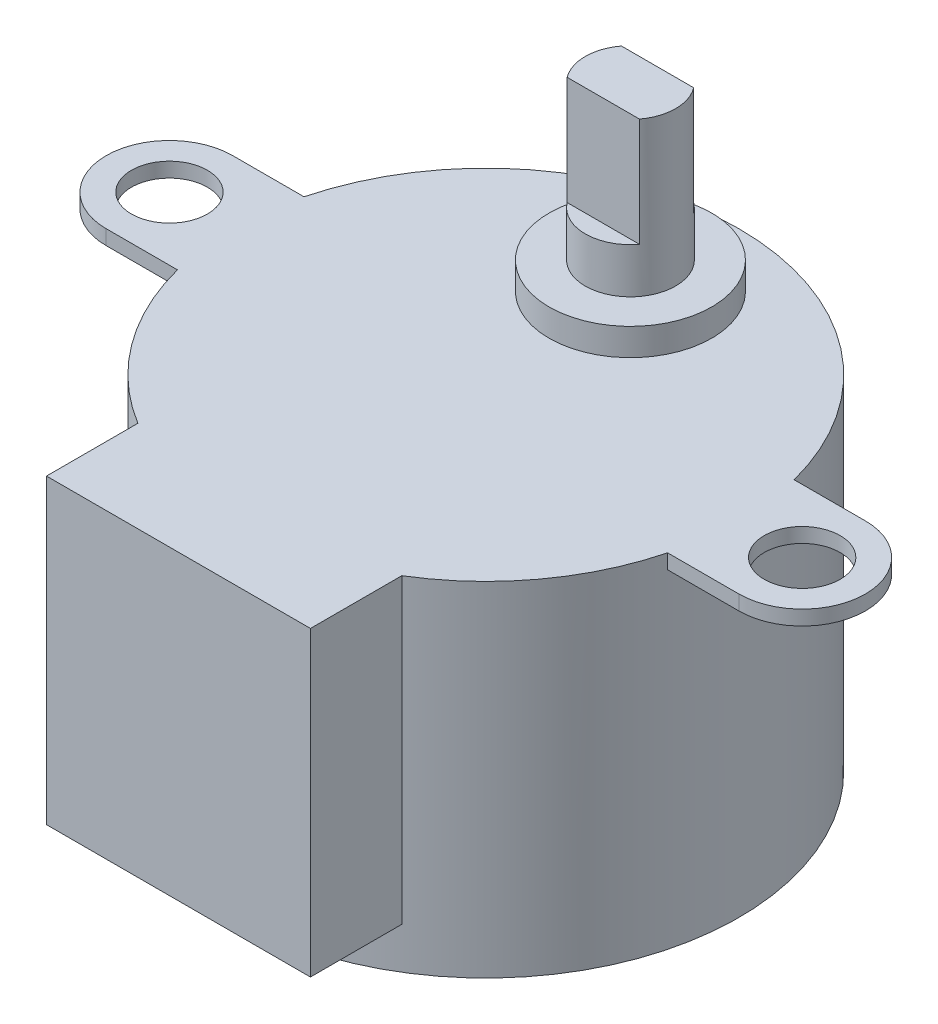
ISO-10303-21;
HEADER;
FILE_DESCRIPTION(('STEP AP214'),'2;1');
FILE_NAME('part.step','',(''),(''),'','','');
FILE_SCHEMA(('AUTOMOTIVE_DESIGN { 1 0 10303 214 1 1 1 1 }'));
ENDSEC;
DATA;
#1=APPLICATION_CONTEXT('core data for automotive mechanical design processes');
#2=APPLICATION_PROTOCOL_DEFINITION('international standard','automotive_design',2000,#1);
#3=PRODUCT_CONTEXT('',#1,'mechanical');
#4=PRODUCT('Part','Part','',(#3));
#5=PRODUCT_RELATED_PRODUCT_CATEGORY('part','',(#4));
#6=PRODUCT_DEFINITION_FORMATION('','',#4);
#7=PRODUCT_DEFINITION_CONTEXT('part definition',#1,'design');
#8=PRODUCT_DEFINITION('design','',#6,#7);
#9=PRODUCT_DEFINITION_SHAPE('','',#8);
#10=(LENGTH_UNIT() NAMED_UNIT(*) SI_UNIT(.MILLI.,.METRE.));
#11=(NAMED_UNIT(*) PLANE_ANGLE_UNIT() SI_UNIT($,.RADIAN.));
#12=(NAMED_UNIT(*) SI_UNIT($,.STERADIAN.) SOLID_ANGLE_UNIT());
#13=UNCERTAINTY_MEASURE_WITH_UNIT(LENGTH_MEASURE(1.E-05),#10,'distance_accuracy_value','');
#14=(GEOMETRIC_REPRESENTATION_CONTEXT(3) GLOBAL_UNCERTAINTY_ASSIGNED_CONTEXT((#13)) GLOBAL_UNIT_ASSIGNED_CONTEXT((#10,
#11,#12)) REPRESENTATION_CONTEXT('',''));
#15=CARTESIAN_POINT('',(0.,0.,0.));
#16=DIRECTION('',(0.,0.,1.));
#17=DIRECTION('',(1.,0.,0.));
#18=AXIS2_PLACEMENT_3D('',#15,#16,#17);
#19=CARTESIAN_POINT('',(0.,10.,-8.));
#20=DIRECTION('',(0.,-1.,0.));
#21=DIRECTION('',(0.,0.,-1.));
#22=AXIS2_PLACEMENT_3D('',#19,#20,#21);
#23=CYLINDRICAL_SURFACE('',#22,2.5);
#24=CARTESIAN_POINT('',(0.,1.5,-8.));
#25=DIRECTION('',(0.,1.,0.));
#26=DIRECTION('',(0.,0.,1.));
#27=AXIS2_PLACEMENT_3D('',#24,#25,#26);
#28=CIRCLE('',#27,2.5);
#29=CARTESIAN_POINT('',(0.,1.5,-5.5));
#30=VERTEX_POINT('',#29);
#31=EDGE_CURVE('E207',#30,#30,#28,.F.);
#32=ORIENTED_EDGE('',*,*,#31,.F.);
#33=EDGE_LOOP('',(#32));
#34=FACE_BOUND('',#33,.T.);
#35=DIRECTION('',(0.,1.,0.));
#36=VECTOR('',#35,1.);
#37=CARTESIAN_POINT('',(-2.,4.,-6.5));
#38=LINE('',#37,#36);
#39=CARTESIAN_POINT('',(-2.,4.,-6.5));
#40=VERTEX_POINT('',#39);
#41=CARTESIAN_POINT('',(-2.,10.,-6.5));
#42=VERTEX_POINT('',#41);
#43=EDGE_CURVE('E185',#40,#42,#38,.T.);
#44=ORIENTED_EDGE('',*,*,#43,.T.);
#45=CARTESIAN_POINT('',(0.,10.,-8.));
#46=DIRECTION('',(0.,1.,0.));
#47=DIRECTION('',(0.,0.,1.));
#48=AXIS2_PLACEMENT_3D('',#45,#46,#47);
#49=CIRCLE('',#48,2.5);
#50=CARTESIAN_POINT('',(-2.,10.,-9.5));
#51=VERTEX_POINT('',#50);
#52=EDGE_CURVE('E204',#51,#42,#49,.T.);
#53=ORIENTED_EDGE('',*,*,#52,.F.);
#54=DIRECTION('',(0.,1.,0.));
#55=VECTOR('',#54,1.);
#56=CARTESIAN_POINT('',(-2.,4.,-9.5));
#57=LINE('',#56,#55);
#58=CARTESIAN_POINT('',(-2.,4.,-9.5));
#59=VERTEX_POINT('',#58);
#60=EDGE_CURVE('E196',#59,#51,#57,.T.);
#61=ORIENTED_EDGE('',*,*,#60,.F.);
#62=CARTESIAN_POINT('',(0.,4.,-8.));
#63=DIRECTION('',(0.,1.,0.));
#64=DIRECTION('',(0.,0.,1.));
#65=AXIS2_PLACEMENT_3D('',#62,#63,#64);
#66=CIRCLE('',#65,2.5);
#67=CARTESIAN_POINT('',(2.,4.,-9.5));
#68=VERTEX_POINT('',#67);
#69=EDGE_CURVE('E191',#68,#59,#66,.T.);
#70=ORIENTED_EDGE('',*,*,#69,.F.);
#71=DIRECTION('',(0.,1.,0.));
#72=VECTOR('',#71,1.);
#73=CARTESIAN_POINT('',(2.,4.,-9.5));
#74=LINE('',#73,#72);
#75=CARTESIAN_POINT('',(2.,10.,-9.5));
#76=VERTEX_POINT('',#75);
#77=EDGE_CURVE('E199',#68,#76,#74,.T.);
#78=ORIENTED_EDGE('',*,*,#77,.T.);
#79=CARTESIAN_POINT('',(2.,10.,-6.5));
#80=VERTEX_POINT('',#79);
#81=EDGE_CURVE('E202',#80,#76,#49,.T.);
#82=ORIENTED_EDGE('',*,*,#81,.F.);
#83=DIRECTION('',(0.,1.,0.));
#84=VECTOR('',#83,1.);
#85=CARTESIAN_POINT('',(2.,4.,-6.5));
#86=LINE('',#85,#84);
#87=CARTESIAN_POINT('',(2.,4.,-6.5));
#88=VERTEX_POINT('',#87);
#89=EDGE_CURVE('E56',#88,#80,#86,.T.);
#90=ORIENTED_EDGE('',*,*,#89,.F.);
#91=CARTESIAN_POINT('',(0.,4.,-8.));
#92=DIRECTION('',(0.,1.,0.));
#93=DIRECTION('',(0.,0.,1.));
#94=AXIS2_PLACEMENT_3D('',#91,#92,#93);
#95=CIRCLE('',#94,2.5);
#96=EDGE_CURVE('E182',#40,#88,#95,.T.);
#97=ORIENTED_EDGE('',*,*,#96,.F.);
#98=EDGE_LOOP('',(#44,#53,#61,#70,#78,#82,#90,#97));
#99=FACE_BOUND('',#98,.T.);
#100=ADVANCED_FACE('F33',(#34,#99),#23,.T.);
#101=CARTESIAN_POINT('',(0.,10.,-8.));
#102=DIRECTION('',(0.,1.,0.));
#103=DIRECTION('',(0.,0.,1.));
#104=AXIS2_PLACEMENT_3D('',#101,#102,#103);
#105=PLANE('',#104);
#106=ORIENTED_EDGE('',*,*,#52,.T.);
#107=DIRECTION('',(1.,0.,0.));
#108=VECTOR('',#107,1.);
#109=CARTESIAN_POINT('',(0.,10.,-6.5));
#110=LINE('',#109,#108);
#111=EDGE_CURVE('E176',#42,#80,#110,.T.);
#112=ORIENTED_EDGE('',*,*,#111,.T.);
#113=ORIENTED_EDGE('',*,*,#81,.T.);
#114=DIRECTION('',(1.,0.,0.));
#115=VECTOR('',#114,1.);
#116=CARTESIAN_POINT('',(0.,10.,-9.5));
#117=LINE('',#116,#115);
#118=EDGE_CURVE('E188',#51,#76,#117,.T.);
#119=ORIENTED_EDGE('',*,*,#118,.F.);
#120=EDGE_LOOP('',(#106,#112,#113,#119));
#121=FACE_BOUND('',#120,.T.);
#122=ADVANCED_FACE('F290',(#121),#105,.T.);
#123=CARTESIAN_POINT('',(0.,-19.,0.));
#124=DIRECTION('',(0.,1.,0.));
#125=DIRECTION('',(0.,0.,1.));
#126=AXIS2_PLACEMENT_3D('',#123,#124,#125);
#127=CYLINDRICAL_SURFACE('',#126,14.);
#128=DIRECTION('',(0.,1.,0.));
#129=VECTOR('',#128,1.);
#130=CARTESIAN_POINT('',(-7.3,-16.7,11.9461290801665));
#131=LINE('',#130,#129);
#132=CARTESIAN_POINT('',(-7.3,-16.7,11.9461290801665));
#133=VERTEX_POINT('',#132);
#134=CARTESIAN_POINT('',(-7.3,0.,11.9461290801665));
#135=VERTEX_POINT('',#134);
#136=EDGE_CURVE('E167',#133,#135,#131,.T.);
#137=ORIENTED_EDGE('',*,*,#136,.T.);
#138=CARTESIAN_POINT('',(0.,0.,0.));
#139=DIRECTION('',(0.,1.,0.));
#140=DIRECTION('',(0.,0.,1.));
#141=AXIS2_PLACEMENT_3D('',#138,#139,#140);
#142=CIRCLE('',#141,14.);
#143=CARTESIAN_POINT('',(-13.555441711726,0.,3.5));
#144=VERTEX_POINT('',#143);
#145=EDGE_CURVE('E278',#144,#135,#142,.T.);
#146=ORIENTED_EDGE('',*,*,#145,.F.);
#147=DIRECTION('',(0.,1.,0.));
#148=VECTOR('',#147,1.);
#149=CARTESIAN_POINT('',(-13.555441711726,-19.,3.5));
#150=LINE('',#149,#148);
#151=CARTESIAN_POINT('',(-13.555441711726,-0.812799999999999,3.5));
#152=VERTEX_POINT('',#151);
#153=EDGE_CURVE('E256',#152,#144,#150,.T.);
#154=ORIENTED_EDGE('',*,*,#153,.F.);
#155=CARTESIAN_POINT('',(0.,-0.812799999999999,0.));
#156=DIRECTION('',(0.,1.,0.));
#157=DIRECTION('',(0.,0.,1.));
#158=AXIS2_PLACEMENT_3D('',#155,#156,#157);
#159=CIRCLE('',#158,14.);
#160=CARTESIAN_POINT('',(-13.555441711726,-0.812799999999999,-3.5));
#161=VERTEX_POINT('',#160);
#162=EDGE_CURVE('E41',#152,#161,#159,.F.);
#163=ORIENTED_EDGE('',*,*,#162,.T.);
#164=DIRECTION('',(0.,1.,0.));
#165=VECTOR('',#164,1.);
#166=CARTESIAN_POINT('',(-13.555441711726,-19.,-3.5));
#167=LINE('',#166,#165);
#168=CARTESIAN_POINT('',(-13.555441711726,0.,-3.5));
#169=VERTEX_POINT('',#168);
#170=EDGE_CURVE('E270',#169,#161,#167,.F.);
#171=ORIENTED_EDGE('',*,*,#170,.F.);
#172=CARTESIAN_POINT('',(13.555441711726,0.,-3.50000000000001));
#173=VERTEX_POINT('',#172);
#174=EDGE_CURVE('E277',#173,#169,#142,.T.);
#175=ORIENTED_EDGE('',*,*,#174,.F.);
#176=DIRECTION('',(0.,1.,0.));
#177=VECTOR('',#176,1.);
#178=CARTESIAN_POINT('',(13.555441711726,-19.,-3.50000000000001));
#179=LINE('',#178,#177);
#180=CARTESIAN_POINT('',(13.555441711726,-0.812799999999999,-3.50000000000001));
#181=VERTEX_POINT('',#180);
#182=EDGE_CURVE('E267',#181,#173,#179,.T.);
#183=ORIENTED_EDGE('',*,*,#182,.F.);
#184=CARTESIAN_POINT('',(13.555441711726,-0.812799999999999,3.49999999999999));
#185=VERTEX_POINT('',#184);
#186=EDGE_CURVE('E276',#181,#185,#159,.F.);
#187=ORIENTED_EDGE('',*,*,#186,.T.);
#188=DIRECTION('',(0.,1.,0.));
#189=VECTOR('',#188,1.);
#190=CARTESIAN_POINT('',(13.555441711726,-19.,3.49999999999999));
#191=LINE('',#190,#189);
#192=CARTESIAN_POINT('',(13.555441711726,0.,3.49999999999999));
#193=VERTEX_POINT('',#192);
#194=EDGE_CURVE('E265',#193,#185,#191,.F.);
#195=ORIENTED_EDGE('',*,*,#194,.F.);
#196=CARTESIAN_POINT('',(7.3,0.,11.9461290801665));
#197=VERTEX_POINT('',#196);
#198=EDGE_CURVE('E272',#197,#193,#142,.T.);
#199=ORIENTED_EDGE('',*,*,#198,.F.);
#200=DIRECTION('',(0.,1.,0.));
#201=VECTOR('',#200,1.);
#202=CARTESIAN_POINT('',(7.3,-16.7,11.9461290801665));
#203=LINE('',#202,#201);
#204=CARTESIAN_POINT('',(7.3,-16.7,11.9461290801665));
#205=VERTEX_POINT('',#204);
#206=EDGE_CURVE('E177',#205,#197,#203,.T.);
#207=ORIENTED_EDGE('',*,*,#206,.F.);
#208=CARTESIAN_POINT('',(0.,-16.7,0.));
#209=DIRECTION('',(0.,1.,0.));
#210=DIRECTION('',(0.,0.,1.));
#211=AXIS2_PLACEMENT_3D('',#208,#209,#210);
#212=CIRCLE('',#211,14.);
#213=EDGE_CURVE('E11',#205,#133,#212,.F.);
#214=ORIENTED_EDGE('',*,*,#213,.T.);
#215=EDGE_LOOP('',(#137,#146,#154,#163,#171,#175,#183,#187,#195,#199,#207,#214));
#216=FACE_BOUND('',#215,.T.);
#217=CARTESIAN_POINT('',(0.,-19.,0.));
#218=DIRECTION('',(0.,1.,0.));
#219=DIRECTION('',(0.,0.,1.));
#220=AXIS2_PLACEMENT_3D('',#217,#218,#219);
#221=CIRCLE('',#220,14.);
#222=CARTESIAN_POINT('',(0.,-19.,14.));
#223=VERTEX_POINT('',#222);
#224=EDGE_CURVE('E273',#223,#223,#221,.T.);
#225=ORIENTED_EDGE('',*,*,#224,.T.);
#226=EDGE_LOOP('',(#225));
#227=FACE_BOUND('',#226,.T.);
#228=ADVANCED_FACE('F35',(#216,#227),#127,.T.);
#229=CARTESIAN_POINT('',(0.,-19.,0.));
#230=DIRECTION('',(0.,1.,0.));
#231=DIRECTION('',(0.,0.,1.));
#232=AXIS2_PLACEMENT_3D('',#229,#230,#231);
#233=PLANE('',#232);
#234=ORIENTED_EDGE('',*,*,#224,.F.);
#235=EDGE_LOOP('',(#234));
#236=FACE_BOUND('',#235,.T.);
#237=ADVANCED_FACE('F357',(#236),#233,.F.);
#238=CARTESIAN_POINT('',(0.,0.,0.));
#239=DIRECTION('',(0.,1.,0.));
#240=DIRECTION('',(0.,0.,1.));
#241=AXIS2_PLACEMENT_3D('',#238,#239,#240);
#242=PLANE('',#241);
#243=ORIENTED_EDGE('',*,*,#145,.T.);
#244=DIRECTION('',(0.,0.,1.));
#245=VECTOR('',#244,1.);
#246=CARTESIAN_POINT('',(-7.3,0.,11.9461290801665));
#247=LINE('',#246,#245);
#248=CARTESIAN_POINT('',(-7.3,0.,17.));
#249=VERTEX_POINT('',#248);
#250=EDGE_CURVE('E172',#135,#249,#247,.T.);
#251=ORIENTED_EDGE('',*,*,#250,.T.);
#252=DIRECTION('',(1.,0.,0.));
#253=VECTOR('',#252,1.);
#254=CARTESIAN_POINT('',(-7.3,0.,17.));
#255=LINE('',#254,#253);
#256=CARTESIAN_POINT('',(7.3,0.,17.));
#257=VERTEX_POINT('',#256);
#258=EDGE_CURVE('E151',#249,#257,#255,.T.);
#259=ORIENTED_EDGE('',*,*,#258,.T.);
#260=DIRECTION('',(0.,0.,-1.));
#261=VECTOR('',#260,1.);
#262=CARTESIAN_POINT('',(7.3,0.,11.9461290801665));
#263=LINE('',#262,#261);
#264=EDGE_CURVE('E48',#257,#197,#263,.T.);
#265=ORIENTED_EDGE('',*,*,#264,.T.);
#266=ORIENTED_EDGE('',*,*,#198,.T.);
#267=DIRECTION('',(1.,0.,0.));
#268=VECTOR('',#267,1.);
#269=CARTESIAN_POINT('',(-17.5,0.,3.5));
#270=LINE('',#269,#268);
#271=CARTESIAN_POINT('',(17.5,0.,3.49999999999999));
#272=VERTEX_POINT('',#271);
#273=EDGE_CURVE('E245',#193,#272,#270,.T.);
#274=ORIENTED_EDGE('',*,*,#273,.T.);
#275=CARTESIAN_POINT('',(17.5,0.,0.));
#276=DIRECTION('',(0.,1.,0.));
#277=DIRECTION('',(0.,0.,1.));
#278=AXIS2_PLACEMENT_3D('',#275,#276,#277);
#279=CIRCLE('',#278,3.5);
#280=CARTESIAN_POINT('',(17.5,0.,-3.50000000000001));
#281=VERTEX_POINT('',#280);
#282=EDGE_CURVE('E248',#272,#281,#279,.T.);
#283=ORIENTED_EDGE('',*,*,#282,.T.);
#284=DIRECTION('',(-1.,0.,0.));
#285=VECTOR('',#284,1.);
#286=CARTESIAN_POINT('',(-17.5,0.,-3.5));
#287=LINE('',#286,#285);
#288=EDGE_CURVE('E231',#281,#173,#287,.T.);
#289=ORIENTED_EDGE('',*,*,#288,.T.);
#290=ORIENTED_EDGE('',*,*,#174,.T.);
#291=CARTESIAN_POINT('',(-17.5,0.,-3.5));
#292=VERTEX_POINT('',#291);
#293=EDGE_CURVE('E251',#169,#292,#287,.T.);
#294=ORIENTED_EDGE('',*,*,#293,.T.);
#295=CARTESIAN_POINT('',(-17.5,0.,0.));
#296=DIRECTION('',(0.,1.,0.));
#297=DIRECTION('',(0.,0.,1.));
#298=AXIS2_PLACEMENT_3D('',#295,#296,#297);
#299=CIRCLE('',#298,3.5);
#300=CARTESIAN_POINT('',(-17.5,0.,3.5));
#301=VERTEX_POINT('',#300);
#302=EDGE_CURVE('E224',#292,#301,#299,.T.);
#303=ORIENTED_EDGE('',*,*,#302,.T.);
#304=EDGE_CURVE('E246',#301,#144,#270,.T.);
#305=ORIENTED_EDGE('',*,*,#304,.T.);
#306=EDGE_LOOP('',(#243,#251,#259,#265,#266,#274,#283,#289,#290,#294,#303,#305));
#307=FACE_BOUND('',#306,.T.);
#308=CARTESIAN_POINT('',(0.,0.,-8.));
#309=DIRECTION('',(0.,1.,0.));
#310=DIRECTION('',(0.,0.,1.));
#311=AXIS2_PLACEMENT_3D('',#308,#309,#310);
#312=CIRCLE('',#311,4.5);
#313=CARTESIAN_POINT('',(0.,0.,-3.5));
#314=VERTEX_POINT('',#313);
#315=EDGE_CURVE('E212',#314,#314,#312,.T.);
#316=ORIENTED_EDGE('',*,*,#315,.F.);
#317=EDGE_LOOP('',(#316));
#318=FACE_BOUND('',#317,.T.);
#319=CARTESIAN_POINT('',(17.5,0.,0.));
#320=DIRECTION('',(0.,1.,0.));
#321=DIRECTION('',(0.,0.,1.));
#322=AXIS2_PLACEMENT_3D('',#319,#320,#321);
#323=CIRCLE('',#322,2.1);
#324=CARTESIAN_POINT('',(17.5,0.,2.09999999999999));
#325=VERTEX_POINT('',#324);
#326=EDGE_CURVE('E211',#325,#325,#323,.T.);
#327=ORIENTED_EDGE('',*,*,#326,.F.);
#328=EDGE_LOOP('',(#327));
#329=FACE_BOUND('',#328,.T.);
#330=CARTESIAN_POINT('',(-17.5,0.,0.));
#331=DIRECTION('',(0.,1.,0.));
#332=DIRECTION('',(0.,0.,1.));
#333=AXIS2_PLACEMENT_3D('',#330,#331,#332);
#334=CIRCLE('',#333,2.1);
#335=CARTESIAN_POINT('',(-17.5,0.,2.1));
#336=VERTEX_POINT('',#335);
#337=EDGE_CURVE('E218',#336,#336,#334,.T.);
#338=ORIENTED_EDGE('',*,*,#337,.F.);
#339=EDGE_LOOP('',(#338));
#340=FACE_BOUND('',#339,.T.);
#341=ADVANCED_FACE('F348',(#307,#318,#329,#340),#242,.T.);
#342=CARTESIAN_POINT('',(17.5,-0.8128,0.));
#343=DIRECTION('',(0.,1.,0.));
#344=DIRECTION('',(0.,0.,1.));
#345=AXIS2_PLACEMENT_3D('',#342,#343,#344);
#346=CYLINDRICAL_SURFACE('',#345,3.5);
#347=ORIENTED_EDGE('',*,*,#282,.F.);
#348=DIRECTION('',(0.,1.,0.));
#349=VECTOR('',#348,1.);
#350=CARTESIAN_POINT('',(17.5,-0.8128,3.49999999999999));
#351=LINE('',#350,#349);
#352=CARTESIAN_POINT('',(17.5,-0.8128,3.49999999999999));
#353=VERTEX_POINT('',#352);
#354=EDGE_CURVE('E259',#353,#272,#351,.T.);
#355=ORIENTED_EDGE('',*,*,#354,.F.);
#356=CARTESIAN_POINT('',(17.5,-0.8128,0.));
#357=DIRECTION('',(0.,1.,0.));
#358=DIRECTION('',(0.,0.,1.));
#359=AXIS2_PLACEMENT_3D('',#356,#357,#358);
#360=CIRCLE('',#359,3.5);
#361=CARTESIAN_POINT('',(17.5,-0.8128,-3.50000000000001));
#362=VERTEX_POINT('',#361);
#363=EDGE_CURVE('E235',#353,#362,#360,.T.);
#364=ORIENTED_EDGE('',*,*,#363,.T.);
#365=DIRECTION('',(0.,1.,0.));
#366=VECTOR('',#365,1.);
#367=CARTESIAN_POINT('',(17.5,-0.8128,-3.50000000000001));
#368=LINE('',#367,#366);
#369=EDGE_CURVE('E257',#362,#281,#368,.T.);
#370=ORIENTED_EDGE('',*,*,#369,.T.);
#371=EDGE_LOOP('',(#347,#355,#364,#370));
#372=FACE_BOUND('',#371,.T.);
#373=ADVANCED_FACE('F338',(#372),#346,.T.);
#374=CARTESIAN_POINT('',(-17.5,-0.8128,0.));
#375=DIRECTION('',(0.,1.,0.));
#376=DIRECTION('',(0.,0.,1.));
#377=AXIS2_PLACEMENT_3D('',#374,#375,#376);
#378=PLANE('',#377);
#379=CARTESIAN_POINT('',(17.5,-0.8128,0.));
#380=DIRECTION('',(0.,1.,0.));
#381=DIRECTION('',(0.,0.,1.));
#382=AXIS2_PLACEMENT_3D('',#379,#380,#381);
#383=CIRCLE('',#382,2.1);
#384=CARTESIAN_POINT('',(17.5,-0.8128,2.09999999999999));
#385=VERTEX_POINT('',#384);
#386=EDGE_CURVE('E215',#385,#385,#383,.T.);
#387=ORIENTED_EDGE('',*,*,#386,.T.);
#388=EDGE_LOOP('',(#387));
#389=FACE_BOUND('',#388,.T.);
#390=ORIENTED_EDGE('',*,*,#186,.F.);
#391=DIRECTION('',(-1.,0.,0.));
#392=VECTOR('',#391,1.);
#393=CARTESIAN_POINT('',(-17.5,-0.8128,-3.5));
#394=LINE('',#393,#392);
#395=EDGE_CURVE('E239',#362,#181,#394,.T.);
#396=ORIENTED_EDGE('',*,*,#395,.F.);
#397=ORIENTED_EDGE('',*,*,#363,.F.);
#398=DIRECTION('',(1.,0.,0.));
#399=VECTOR('',#398,1.);
#400=CARTESIAN_POINT('',(-17.5,-0.8128,3.5));
#401=LINE('',#400,#399);
#402=EDGE_CURVE('E230',#185,#353,#401,.T.);
#403=ORIENTED_EDGE('',*,*,#402,.F.);
#404=EDGE_LOOP('',(#390,#396,#397,#403));
#405=FACE_BOUND('',#404,.T.);
#406=ADVANCED_FACE('F334',(#389,#405),#378,.F.);
#407=CARTESIAN_POINT('',(-17.5,-0.8128,3.5));
#408=DIRECTION('',(0.,0.,1.));
#409=DIRECTION('',(1.,0.,0.));
#410=AXIS2_PLACEMENT_3D('',#407,#408,#409);
#411=PLANE('',#410);
#412=ORIENTED_EDGE('',*,*,#273,.F.);
#413=ORIENTED_EDGE('',*,*,#194,.T.);
#414=ORIENTED_EDGE('',*,*,#402,.T.);
#415=ORIENTED_EDGE('',*,*,#354,.T.);
#416=EDGE_LOOP('',(#412,#413,#414,#415));
#417=FACE_BOUND('',#416,.T.);
#418=ADVANCED_FACE('F337',(#417),#411,.T.);
#419=CARTESIAN_POINT('',(-17.5,-0.8128,-3.5));
#420=DIRECTION('',(0.,0.,-1.));
#421=DIRECTION('',(-1.,0.,0.));
#422=AXIS2_PLACEMENT_3D('',#419,#420,#421);
#423=PLANE('',#422);
#424=ORIENTED_EDGE('',*,*,#395,.T.);
#425=ORIENTED_EDGE('',*,*,#182,.T.);
#426=ORIENTED_EDGE('',*,*,#288,.F.);
#427=ORIENTED_EDGE('',*,*,#369,.F.);
#428=EDGE_LOOP('',(#424,#425,#426,#427));
#429=FACE_BOUND('',#428,.T.);
#430=ADVANCED_FACE('F341',(#429),#423,.T.);
#431=CARTESIAN_POINT('',(-17.5,-0.8128,0.));
#432=DIRECTION('',(0.,1.,0.));
#433=DIRECTION('',(0.,0.,1.));
#434=AXIS2_PLACEMENT_3D('',#431,#432,#433);
#435=CIRCLE('',#434,2.1);
#436=CARTESIAN_POINT('',(-17.5,-0.8128,2.1));
#437=VERTEX_POINT('',#436);
#438=EDGE_CURVE('E221',#437,#437,#435,.T.);
#439=ORIENTED_EDGE('',*,*,#438,.T.);
#440=EDGE_LOOP('',(#439));
#441=FACE_BOUND('',#440,.T.);
#442=ORIENTED_EDGE('',*,*,#162,.F.);
#443=CARTESIAN_POINT('',(-17.5,-0.8128,3.5));
#444=VERTEX_POINT('',#443);
#445=EDGE_CURVE('E232',#444,#152,#401,.T.);
#446=ORIENTED_EDGE('',*,*,#445,.F.);
#447=CARTESIAN_POINT('',(-17.5,-0.8128,0.));
#448=DIRECTION('',(0.,1.,0.));
#449=DIRECTION('',(0.,0.,1.));
#450=AXIS2_PLACEMENT_3D('',#447,#448,#449);
#451=CIRCLE('',#450,3.5);
#452=CARTESIAN_POINT('',(-17.5,-0.8128,-3.5));
#453=VERTEX_POINT('',#452);
#454=EDGE_CURVE('E227',#453,#444,#451,.T.);
#455=ORIENTED_EDGE('',*,*,#454,.F.);
#456=EDGE_CURVE('E238',#161,#453,#394,.T.);
#457=ORIENTED_EDGE('',*,*,#456,.F.);
#458=EDGE_LOOP('',(#442,#446,#455,#457));
#459=FACE_BOUND('',#458,.T.);
#460=ADVANCED_FACE('F340',(#441,#459),#378,.F.);
#461=ORIENTED_EDGE('',*,*,#293,.F.);
#462=ORIENTED_EDGE('',*,*,#170,.T.);
#463=ORIENTED_EDGE('',*,*,#456,.T.);
#464=DIRECTION('',(0.,1.,0.));
#465=VECTOR('',#464,1.);
#466=CARTESIAN_POINT('',(-17.5,-0.8128,-3.5));
#467=LINE('',#466,#465);
#468=EDGE_CURVE('E253',#453,#292,#467,.T.);
#469=ORIENTED_EDGE('',*,*,#468,.T.);
#470=EDGE_LOOP('',(#461,#462,#463,#469));
#471=FACE_BOUND('',#470,.T.);
#472=ADVANCED_FACE('F345',(#471),#423,.T.);
#473=CARTESIAN_POINT('',(-17.5,-0.8128,0.));
#474=DIRECTION('',(0.,1.,0.));
#475=DIRECTION('',(0.,0.,1.));
#476=AXIS2_PLACEMENT_3D('',#473,#474,#475);
#477=CYLINDRICAL_SURFACE('',#476,3.5);
#478=ORIENTED_EDGE('',*,*,#302,.F.);
#479=ORIENTED_EDGE('',*,*,#468,.F.);
#480=ORIENTED_EDGE('',*,*,#454,.T.);
#481=DIRECTION('',(0.,1.,0.));
#482=VECTOR('',#481,1.);
#483=CARTESIAN_POINT('',(-17.5,-0.8128,3.5));
#484=LINE('',#483,#482);
#485=EDGE_CURVE('E242',#444,#301,#484,.T.);
#486=ORIENTED_EDGE('',*,*,#485,.T.);
#487=EDGE_LOOP('',(#478,#479,#480,#486));
#488=FACE_BOUND('',#487,.T.);
#489=ADVANCED_FACE('F352',(#488),#477,.T.);
#490=ORIENTED_EDGE('',*,*,#445,.T.);
#491=ORIENTED_EDGE('',*,*,#153,.T.);
#492=ORIENTED_EDGE('',*,*,#304,.F.);
#493=ORIENTED_EDGE('',*,*,#485,.F.);
#494=EDGE_LOOP('',(#490,#491,#492,#493));
#495=FACE_BOUND('',#494,.T.);
#496=ADVANCED_FACE('F332',(#495),#411,.T.);
#497=CARTESIAN_POINT('',(-17.5,-0.8128,0.));
#498=DIRECTION('',(0.,1.,0.));
#499=DIRECTION('',(0.,0.,1.));
#500=AXIS2_PLACEMENT_3D('',#497,#498,#499);
#501=CYLINDRICAL_SURFACE('',#500,2.1);
#502=ORIENTED_EDGE('',*,*,#438,.F.);
#503=EDGE_LOOP('',(#502));
#504=FACE_BOUND('',#503,.T.);
#505=ORIENTED_EDGE('',*,*,#337,.T.);
#506=EDGE_LOOP('',(#505));
#507=FACE_BOUND('',#506,.T.);
#508=ADVANCED_FACE('F328',(#504,#507),#501,.F.);
#509=CARTESIAN_POINT('',(17.5,-0.8128,0.));
#510=DIRECTION('',(0.,1.,0.));
#511=DIRECTION('',(0.,0.,1.));
#512=AXIS2_PLACEMENT_3D('',#509,#510,#511);
#513=CYLINDRICAL_SURFACE('',#512,2.1);
#514=ORIENTED_EDGE('',*,*,#386,.F.);
#515=EDGE_LOOP('',(#514));
#516=FACE_BOUND('',#515,.T.);
#517=ORIENTED_EDGE('',*,*,#326,.T.);
#518=EDGE_LOOP('',(#517));
#519=FACE_BOUND('',#518,.T.);
#520=ADVANCED_FACE('F324',(#516,#519),#513,.F.);
#521=CARTESIAN_POINT('',(0.,1.5,-8.));
#522=DIRECTION('',(0.,-1.,0.));
#523=DIRECTION('',(0.,0.,-1.));
#524=AXIS2_PLACEMENT_3D('',#521,#522,#523);
#525=CYLINDRICAL_SURFACE('',#524,4.5);
#526=CARTESIAN_POINT('',(0.,1.5,-8.));
#527=DIRECTION('',(0.,1.,0.));
#528=DIRECTION('',(0.,0.,1.));
#529=AXIS2_PLACEMENT_3D('',#526,#527,#528);
#530=CIRCLE('',#529,4.5);
#531=CARTESIAN_POINT('',(0.,1.5,-3.5));
#532=VERTEX_POINT('',#531);
#533=EDGE_CURVE('E208',#532,#532,#530,.T.);
#534=ORIENTED_EDGE('',*,*,#533,.F.);
#535=EDGE_LOOP('',(#534));
#536=FACE_BOUND('',#535,.T.);
#537=ORIENTED_EDGE('',*,*,#315,.T.);
#538=EDGE_LOOP('',(#537));
#539=FACE_BOUND('',#538,.T.);
#540=ADVANCED_FACE('F321',(#536,#539),#525,.T.);
#541=CARTESIAN_POINT('',(0.,1.5,-8.));
#542=DIRECTION('',(0.,1.,0.));
#543=DIRECTION('',(0.,0.,1.));
#544=AXIS2_PLACEMENT_3D('',#541,#542,#543);
#545=PLANE('',#544);
#546=ORIENTED_EDGE('',*,*,#31,.T.);
#547=EDGE_LOOP('',(#546));
#548=FACE_BOUND('',#547,.T.);
#549=ORIENTED_EDGE('',*,*,#533,.T.);
#550=EDGE_LOOP('',(#549));
#551=FACE_BOUND('',#550,.T.);
#552=ADVANCED_FACE('F285',(#548,#551),#545,.T.);
#553=CARTESIAN_POINT('',(0.,4.,-9.5));
#554=DIRECTION('',(0.,0.,1.));
#555=DIRECTION('',(1.,0.,0.));
#556=AXIS2_PLACEMENT_3D('',#553,#554,#555);
#557=PLANE('',#556);
#558=ORIENTED_EDGE('',*,*,#118,.T.);
#559=ORIENTED_EDGE('',*,*,#77,.F.);
#560=DIRECTION('',(1.,0.,0.));
#561=VECTOR('',#560,1.);
#562=CARTESIAN_POINT('',(0.,4.,-9.5));
#563=LINE('',#562,#561);
#564=EDGE_CURVE('E193',#59,#68,#563,.T.);
#565=ORIENTED_EDGE('',*,*,#564,.F.);
#566=ORIENTED_EDGE('',*,*,#60,.T.);
#567=EDGE_LOOP('',(#558,#559,#565,#566));
#568=FACE_BOUND('',#567,.T.);
#569=ADVANCED_FACE('F300',(#568),#557,.F.);
#570=CARTESIAN_POINT('',(0.,4.,0.));
#571=DIRECTION('',(0.,1.,0.));
#572=DIRECTION('',(0.,0.,1.));
#573=AXIS2_PLACEMENT_3D('',#570,#571,#572);
#574=PLANE('',#573);
#575=ORIENTED_EDGE('',*,*,#69,.T.);
#576=ORIENTED_EDGE('',*,*,#564,.T.);
#577=EDGE_LOOP('',(#575,#576));
#578=FACE_BOUND('',#577,.T.);
#579=ADVANCED_FACE('F304',(#578),#574,.T.);
#580=CARTESIAN_POINT('',(0.,4.,-6.5));
#581=DIRECTION('',(0.,0.,1.));
#582=DIRECTION('',(1.,0.,0.));
#583=AXIS2_PLACEMENT_3D('',#580,#581,#582);
#584=PLANE('',#583);
#585=ORIENTED_EDGE('',*,*,#111,.F.);
#586=ORIENTED_EDGE('',*,*,#43,.F.);
#587=DIRECTION('',(1.,0.,0.));
#588=VECTOR('',#587,1.);
#589=CARTESIAN_POINT('',(0.,4.,-6.5));
#590=LINE('',#589,#588);
#591=EDGE_CURVE('E180',#40,#88,#590,.T.);
#592=ORIENTED_EDGE('',*,*,#591,.T.);
#593=ORIENTED_EDGE('',*,*,#89,.T.);
#594=EDGE_LOOP('',(#585,#586,#592,#593));
#595=FACE_BOUND('',#594,.T.);
#596=ADVANCED_FACE('F306',(#595),#584,.T.);
#597=CARTESIAN_POINT('',(0.,4.,0.));
#598=DIRECTION('',(0.,1.,0.));
#599=DIRECTION('',(0.,0.,1.));
#600=AXIS2_PLACEMENT_3D('',#597,#598,#599);
#601=PLANE('',#600);
#602=ORIENTED_EDGE('',*,*,#591,.F.);
#603=ORIENTED_EDGE('',*,*,#96,.T.);
#604=EDGE_LOOP('',(#602,#603));
#605=FACE_BOUND('',#604,.T.);
#606=ADVANCED_FACE('F312',(#605),#601,.T.);
#607=CARTESIAN_POINT('',(-7.3,-16.7,11.9461290801665));
#608=DIRECTION('',(-1.,0.,0.));
#609=DIRECTION('',(0.,0.,1.));
#610=AXIS2_PLACEMENT_3D('',#607,#608,#609);
#611=PLANE('',#610);
#612=ORIENTED_EDGE('',*,*,#250,.F.);
#613=ORIENTED_EDGE('',*,*,#136,.F.);
#614=DIRECTION('',(0.,0.,1.));
#615=VECTOR('',#614,1.);
#616=CARTESIAN_POINT('',(-7.3,-16.7,11.9461290801665));
#617=LINE('',#616,#615);
#618=CARTESIAN_POINT('',(-7.3,-16.7,17.));
#619=VERTEX_POINT('',#618);
#620=EDGE_CURVE('E162',#133,#619,#617,.T.);
#621=ORIENTED_EDGE('',*,*,#620,.T.);
#622=DIRECTION('',(0.,1.,0.));
#623=VECTOR('',#622,1.);
#624=CARTESIAN_POINT('',(-7.3,-16.7,17.));
#625=LINE('',#624,#623);
#626=EDGE_CURVE('E147',#619,#249,#625,.T.);
#627=ORIENTED_EDGE('',*,*,#626,.T.);
#628=EDGE_LOOP('',(#612,#613,#621,#627));
#629=FACE_BOUND('',#628,.T.);
#630=ADVANCED_FACE('F165',(#629),#611,.T.);
#631=CARTESIAN_POINT('',(7.3,-16.7,11.9461290801665));
#632=DIRECTION('',(1.,0.,0.));
#633=DIRECTION('',(0.,0.,-1.));
#634=AXIS2_PLACEMENT_3D('',#631,#632,#633);
#635=PLANE('',#634);
#636=ORIENTED_EDGE('',*,*,#264,.F.);
#637=DIRECTION('',(0.,1.,0.));
#638=VECTOR('',#637,1.);
#639=CARTESIAN_POINT('',(7.3,-16.7,17.));
#640=LINE('',#639,#638);
#641=CARTESIAN_POINT('',(7.3,-16.7,17.));
#642=VERTEX_POINT('',#641);
#643=EDGE_CURVE('E155',#642,#257,#640,.T.);
#644=ORIENTED_EDGE('',*,*,#643,.F.);
#645=DIRECTION('',(0.,0.,-1.));
#646=VECTOR('',#645,1.);
#647=CARTESIAN_POINT('',(7.3,-16.7,11.9461290801665));
#648=LINE('',#647,#646);
#649=EDGE_CURVE('E156',#642,#205,#648,.T.);
#650=ORIENTED_EDGE('',*,*,#649,.T.);
#651=ORIENTED_EDGE('',*,*,#206,.T.);
#652=EDGE_LOOP('',(#636,#644,#650,#651));
#653=FACE_BOUND('',#652,.T.);
#654=ADVANCED_FACE('F383',(#653),#635,.T.);
#655=CARTESIAN_POINT('',(-7.3,-16.7,17.));
#656=DIRECTION('',(0.,0.,1.));
#657=DIRECTION('',(1.,0.,0.));
#658=AXIS2_PLACEMENT_3D('',#655,#656,#657);
#659=PLANE('',#658);
#660=ORIENTED_EDGE('',*,*,#258,.F.);
#661=ORIENTED_EDGE('',*,*,#626,.F.);
#662=DIRECTION('',(1.,0.,0.));
#663=VECTOR('',#662,1.);
#664=CARTESIAN_POINT('',(-7.3,-16.7,17.));
#665=LINE('',#664,#663);
#666=EDGE_CURVE('E150',#619,#642,#665,.T.);
#667=ORIENTED_EDGE('',*,*,#666,.T.);
#668=ORIENTED_EDGE('',*,*,#643,.T.);
#669=EDGE_LOOP('',(#660,#661,#667,#668));
#670=FACE_BOUND('',#669,.T.);
#671=ADVANCED_FACE('F149',(#670),#659,.T.);
#672=CARTESIAN_POINT('',(0.,-16.7,0.));
#673=DIRECTION('',(0.,1.,0.));
#674=DIRECTION('',(0.,0.,1.));
#675=AXIS2_PLACEMENT_3D('',#672,#673,#674);
#676=PLANE('',#675);
#677=ORIENTED_EDGE('',*,*,#213,.F.);
#678=ORIENTED_EDGE('',*,*,#649,.F.);
#679=ORIENTED_EDGE('',*,*,#666,.F.);
#680=ORIENTED_EDGE('',*,*,#620,.F.);
#681=EDGE_LOOP('',(#677,#678,#679,#680));
#682=FACE_BOUND('',#681,.T.);
#683=ADVANCED_FACE('F161',(#682),#676,.F.);
#684=CLOSED_SHELL('',(#100,#122,#228,#237,#341,#373,#406,#418,#430,#460,#472,#489,#496,#508,
#520,#540,#552,#569,#579,#596,#606,#630,#654,#671,#683));
#685=MANIFOLD_SOLID_BREP('B2',#684);
#686=ADVANCED_BREP_SHAPE_REPRESENTATION('',(#18,#685),#14);
#687=SHAPE_DEFINITION_REPRESENTATION(#9,#686);
ENDSEC;
END-ISO-10303-21;
